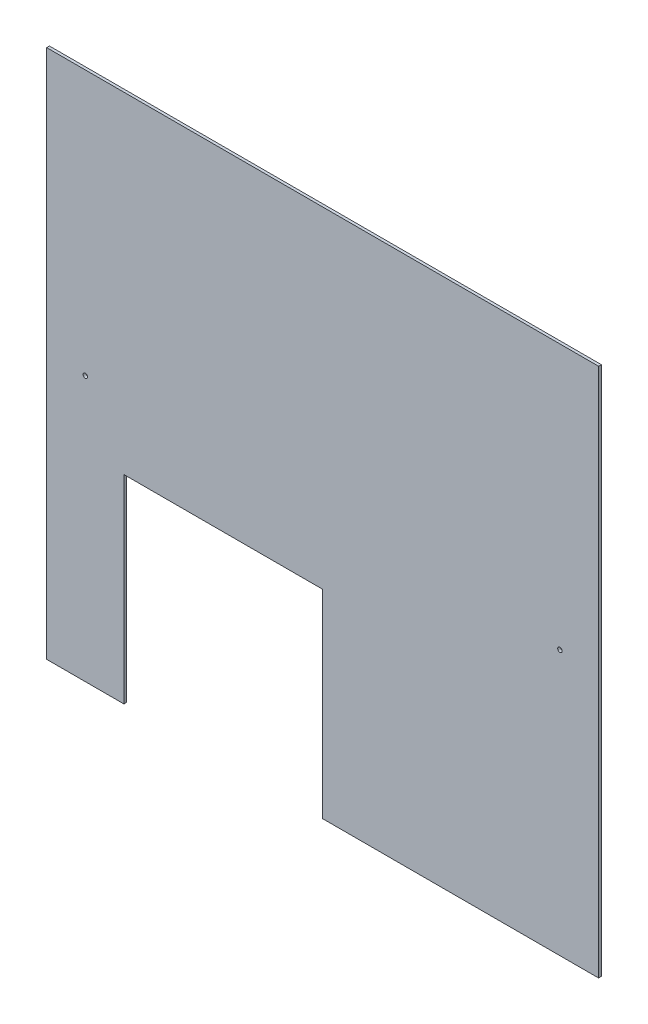
ISO-10303-21;
HEADER;
FILE_DESCRIPTION(('STEP AP214'),'2;1');
FILE_NAME('part.step','',(''),(''),'','','');
FILE_SCHEMA(('AUTOMOTIVE_DESIGN { 1 0 10303 214 1 1 1 1 }'));
ENDSEC;
DATA;
#1=APPLICATION_CONTEXT('core data for automotive mechanical design processes');
#2=APPLICATION_PROTOCOL_DEFINITION('international standard','automotive_design',2000,#1);
#3=PRODUCT_CONTEXT('',#1,'mechanical');
#4=PRODUCT('Part','Part','',(#3));
#5=PRODUCT_RELATED_PRODUCT_CATEGORY('part','',(#4));
#6=PRODUCT_DEFINITION_FORMATION('','',#4);
#7=PRODUCT_DEFINITION_CONTEXT('part definition',#1,'design');
#8=PRODUCT_DEFINITION('design','',#6,#7);
#9=PRODUCT_DEFINITION_SHAPE('','',#8);
#10=(LENGTH_UNIT() NAMED_UNIT(*) SI_UNIT(.MILLI.,.METRE.));
#11=(NAMED_UNIT(*) PLANE_ANGLE_UNIT() SI_UNIT($,.RADIAN.));
#12=(NAMED_UNIT(*) SI_UNIT($,.STERADIAN.) SOLID_ANGLE_UNIT());
#13=UNCERTAINTY_MEASURE_WITH_UNIT(LENGTH_MEASURE(1.E-05),#10,'distance_accuracy_value','');
#14=(GEOMETRIC_REPRESENTATION_CONTEXT(3) GLOBAL_UNCERTAINTY_ASSIGNED_CONTEXT((#13)) GLOBAL_UNIT_ASSIGNED_CONTEXT((#10,
#11,#12)) REPRESENTATION_CONTEXT('',''));
#15=CARTESIAN_POINT('',(0.,0.,0.));
#16=DIRECTION('',(0.,0.,1.));
#17=DIRECTION('',(1.,0.,0.));
#18=AXIS2_PLACEMENT_3D('',#15,#16,#17);
#19=CARTESIAN_POINT('',(-307.14399363564,177.315035799523,3.175));
#20=DIRECTION('',(1.,0.,0.));
#21=DIRECTION('',(0.,0.,-1.));
#22=AXIS2_PLACEMENT_3D('',#19,#20,#21);
#23=PLANE('',#22);
#24=DIRECTION('',(0.,-1.,0.));
#25=VECTOR('',#24,1.);
#26=CARTESIAN_POINT('',(-307.14399363564,177.315035799523,0.));
#27=LINE('',#26,#25);
#28=CARTESIAN_POINT('',(-307.14399363564,177.315035799523,0.));
#29=VERTEX_POINT('',#28);
#30=CARTESIAN_POINT('',(-307.14399363564,-432.284964200477,0.));
#31=VERTEX_POINT('',#30);
#32=EDGE_CURVE('E132',#29,#31,#27,.T.);
#33=ORIENTED_EDGE('',*,*,#32,.T.);
#34=DIRECTION('',(0.,0.,-1.));
#35=VECTOR('',#34,1.);
#36=CARTESIAN_POINT('',(-307.14399363564,-432.284964200477,3.175));
#37=LINE('',#36,#35);
#38=CARTESIAN_POINT('',(-307.14399363564,-432.284964200477,3.175));
#39=VERTEX_POINT('',#38);
#40=EDGE_CURVE('E11',#39,#31,#37,.T.);
#41=ORIENTED_EDGE('',*,*,#40,.F.);
#42=DIRECTION('',(0.,-1.,0.));
#43=VECTOR('',#42,1.);
#44=CARTESIAN_POINT('',(-307.14399363564,177.315035799523,3.175));
#45=LINE('',#44,#43);
#46=CARTESIAN_POINT('',(-307.14399363564,177.315035799523,3.175));
#47=VERTEX_POINT('',#46);
#48=EDGE_CURVE('E147',#47,#39,#45,.T.);
#49=ORIENTED_EDGE('',*,*,#48,.F.);
#50=DIRECTION('',(0.,0.,-1.));
#51=VECTOR('',#50,1.);
#52=CARTESIAN_POINT('',(-307.14399363564,177.315035799523,3.175));
#53=LINE('',#52,#51);
#54=EDGE_CURVE('E128',#47,#29,#53,.T.);
#55=ORIENTED_EDGE('',*,*,#54,.T.);
#56=EDGE_LOOP('',(#33,#41,#49,#55));
#57=FACE_BOUND('',#56,.T.);
#58=ADVANCED_FACE('F36',(#57),#23,.F.);
#59=CARTESIAN_POINT('',(-307.14399363564,-432.284964200477,3.175));
#60=DIRECTION('',(0.,1.,0.));
#61=DIRECTION('',(0.,0.,1.));
#62=AXIS2_PLACEMENT_3D('',#59,#60,#61);
#63=PLANE('',#62);
#64=DIRECTION('',(1.,0.,0.));
#65=VECTOR('',#64,1.);
#66=CARTESIAN_POINT('',(-307.14399363564,-432.284964200477,0.));
#67=LINE('',#66,#65);
#68=CARTESIAN_POINT('',(-218.24399363564,-432.284964200477,0.));
#69=VERTEX_POINT('',#68);
#70=EDGE_CURVE('E135',#31,#69,#67,.T.);
#71=ORIENTED_EDGE('',*,*,#70,.T.);
#72=DIRECTION('',(0.,0.,-1.));
#73=VECTOR('',#72,1.);
#74=CARTESIAN_POINT('',(-218.24399363564,-432.284964200477,3.175));
#75=LINE('',#74,#73);
#76=CARTESIAN_POINT('',(-218.24399363564,-432.284964200477,3.175));
#77=VERTEX_POINT('',#76);
#78=EDGE_CURVE('E44',#77,#69,#75,.T.);
#79=ORIENTED_EDGE('',*,*,#78,.F.);
#80=DIRECTION('',(1.,0.,0.));
#81=VECTOR('',#80,1.);
#82=CARTESIAN_POINT('',(-307.14399363564,-432.284964200477,3.175));
#83=LINE('',#82,#81);
#84=EDGE_CURVE('E95',#39,#77,#83,.T.);
#85=ORIENTED_EDGE('',*,*,#84,.F.);
#86=ORIENTED_EDGE('',*,*,#40,.T.);
#87=EDGE_LOOP('',(#71,#79,#85,#86));
#88=FACE_BOUND('',#87,.T.);
#89=ADVANCED_FACE('F216',(#88),#63,.F.);
#90=CARTESIAN_POINT('',(-218.24399363564,-432.284964200477,3.175));
#91=DIRECTION('',(-1.,0.,0.));
#92=DIRECTION('',(0.,0.,1.));
#93=AXIS2_PLACEMENT_3D('',#90,#91,#92);
#94=PLANE('',#93);
#95=DIRECTION('',(0.,1.,0.));
#96=VECTOR('',#95,1.);
#97=CARTESIAN_POINT('',(-218.24399363564,-432.284964200477,0.));
#98=LINE('',#97,#96);
#99=CARTESIAN_POINT('',(-218.24399363564,-203.684964200477,0.));
#100=VERTEX_POINT('',#99);
#101=EDGE_CURVE('E138',#69,#100,#98,.T.);
#102=ORIENTED_EDGE('',*,*,#101,.T.);
#103=DIRECTION('',(0.,0.,-1.));
#104=VECTOR('',#103,1.);
#105=CARTESIAN_POINT('',(-218.24399363564,-203.684964200477,3.175));
#106=LINE('',#105,#104);
#107=CARTESIAN_POINT('',(-218.24399363564,-203.684964200477,3.175));
#108=VERTEX_POINT('',#107);
#109=EDGE_CURVE('E154',#108,#100,#106,.T.);
#110=ORIENTED_EDGE('',*,*,#109,.F.);
#111=DIRECTION('',(0.,1.,0.));
#112=VECTOR('',#111,1.);
#113=CARTESIAN_POINT('',(-218.24399363564,-432.284964200477,3.175));
#114=LINE('',#113,#112);
#115=EDGE_CURVE('E162',#77,#108,#114,.T.);
#116=ORIENTED_EDGE('',*,*,#115,.F.);
#117=ORIENTED_EDGE('',*,*,#78,.T.);
#118=EDGE_LOOP('',(#102,#110,#116,#117));
#119=FACE_BOUND('',#118,.T.);
#120=ADVANCED_FACE('F160',(#119),#94,.F.);
#121=CARTESIAN_POINT('',(-218.24399363564,-203.684964200477,3.175));
#122=DIRECTION('',(0.,1.,0.));
#123=DIRECTION('',(0.,0.,1.));
#124=AXIS2_PLACEMENT_3D('',#121,#122,#123);
#125=PLANE('',#124);
#126=DIRECTION('',(1.,0.,0.));
#127=VECTOR('',#126,1.);
#128=CARTESIAN_POINT('',(-218.24399363564,-203.684964200477,0.));
#129=LINE('',#128,#127);
#130=CARTESIAN_POINT('',(10.3560063643596,-203.684964200477,0.));
#131=VERTEX_POINT('',#130);
#132=EDGE_CURVE('E140',#100,#131,#129,.T.);
#133=ORIENTED_EDGE('',*,*,#132,.T.);
#134=DIRECTION('',(0.,0.,-1.));
#135=VECTOR('',#134,1.);
#136=CARTESIAN_POINT('',(10.3560063643596,-203.684964200477,3.175));
#137=LINE('',#136,#135);
#138=CARTESIAN_POINT('',(10.3560063643596,-203.684964200477,3.175));
#139=VERTEX_POINT('',#138);
#140=EDGE_CURVE('E151',#139,#131,#137,.T.);
#141=ORIENTED_EDGE('',*,*,#140,.F.);
#142=DIRECTION('',(1.,0.,0.));
#143=VECTOR('',#142,1.);
#144=CARTESIAN_POINT('',(-218.24399363564,-203.684964200477,3.175));
#145=LINE('',#144,#143);
#146=EDGE_CURVE('E174',#108,#139,#145,.T.);
#147=ORIENTED_EDGE('',*,*,#146,.F.);
#148=ORIENTED_EDGE('',*,*,#109,.T.);
#149=EDGE_LOOP('',(#133,#141,#147,#148));
#150=FACE_BOUND('',#149,.T.);
#151=ADVANCED_FACE('F170',(#150),#125,.F.);
#152=CARTESIAN_POINT('',(10.3560063643596,-203.684964200477,3.175));
#153=DIRECTION('',(1.,0.,0.));
#154=DIRECTION('',(0.,1.,0.));
#155=AXIS2_PLACEMENT_3D('',#152,#153,#154);
#156=PLANE('',#155);
#157=DIRECTION('',(0.,-1.,0.));
#158=VECTOR('',#157,1.);
#159=CARTESIAN_POINT('',(10.3560063643596,-203.684964200477,0.));
#160=LINE('',#159,#158);
#161=CARTESIAN_POINT('',(10.3560063643596,-432.284964200477,0.));
#162=VERTEX_POINT('',#161);
#163=EDGE_CURVE('E142',#131,#162,#160,.T.);
#164=ORIENTED_EDGE('',*,*,#163,.T.);
#165=DIRECTION('',(0.,0.,-1.));
#166=VECTOR('',#165,1.);
#167=CARTESIAN_POINT('',(10.3560063643596,-432.284964200477,3.175));
#168=LINE('',#167,#166);
#169=CARTESIAN_POINT('',(10.3560063643596,-432.284964200477,3.175));
#170=VERTEX_POINT('',#169);
#171=EDGE_CURVE('E123',#170,#162,#168,.T.);
#172=ORIENTED_EDGE('',*,*,#171,.F.);
#173=DIRECTION('',(0.,-1.,0.));
#174=VECTOR('',#173,1.);
#175=CARTESIAN_POINT('',(10.3560063643596,-203.684964200477,3.175));
#176=LINE('',#175,#174);
#177=EDGE_CURVE('E114',#139,#170,#176,.T.);
#178=ORIENTED_EDGE('',*,*,#177,.F.);
#179=ORIENTED_EDGE('',*,*,#140,.T.);
#180=EDGE_LOOP('',(#164,#172,#178,#179));
#181=FACE_BOUND('',#180,.T.);
#182=ADVANCED_FACE('F173',(#181),#156,.F.);
#183=CARTESIAN_POINT('',(10.3560063643596,-432.284964200477,3.175));
#184=DIRECTION('',(0.,1.,0.));
#185=DIRECTION('',(0.,0.,1.));
#186=AXIS2_PLACEMENT_3D('',#183,#184,#185);
#187=PLANE('',#186);
#188=DIRECTION('',(1.,0.,0.));
#189=VECTOR('',#188,1.);
#190=CARTESIAN_POINT('',(10.3560063643596,-432.284964200477,0.));
#191=LINE('',#190,#189);
#192=CARTESIAN_POINT('',(327.85600636436,-432.284964200477,0.));
#193=VERTEX_POINT('',#192);
#194=EDGE_CURVE('E122',#162,#193,#191,.T.);
#195=ORIENTED_EDGE('',*,*,#194,.T.);
#196=DIRECTION('',(0.,0.,-1.));
#197=VECTOR('',#196,1.);
#198=CARTESIAN_POINT('',(327.85600636436,-432.284964200477,3.175));
#199=LINE('',#198,#197);
#200=CARTESIAN_POINT('',(327.85600636436,-432.284964200477,3.175));
#201=VERTEX_POINT('',#200);
#202=EDGE_CURVE('E119',#201,#193,#199,.T.);
#203=ORIENTED_EDGE('',*,*,#202,.F.);
#204=DIRECTION('',(1.,0.,0.));
#205=VECTOR('',#204,1.);
#206=CARTESIAN_POINT('',(10.3560063643596,-432.284964200477,3.175));
#207=LINE('',#206,#205);
#208=EDGE_CURVE('E108',#170,#201,#207,.T.);
#209=ORIENTED_EDGE('',*,*,#208,.F.);
#210=ORIENTED_EDGE('',*,*,#171,.T.);
#211=EDGE_LOOP('',(#195,#203,#209,#210));
#212=FACE_BOUND('',#211,.T.);
#213=ADVANCED_FACE('F120',(#212),#187,.F.);
#214=CARTESIAN_POINT('',(327.85600636436,177.315035799523,3.175));
#215=DIRECTION('',(-1.,0.,0.));
#216=DIRECTION('',(0.,-1.,0.));
#217=AXIS2_PLACEMENT_3D('',#214,#215,#216);
#218=PLANE('',#217);
#219=DIRECTION('',(0.,1.,0.));
#220=VECTOR('',#219,1.);
#221=CARTESIAN_POINT('',(327.85600636436,177.315035799523,0.));
#222=LINE('',#221,#220);
#223=CARTESIAN_POINT('',(327.85600636436,177.315035799523,0.));
#224=VERTEX_POINT('',#223);
#225=EDGE_CURVE('E81',#193,#224,#222,.T.);
#226=ORIENTED_EDGE('',*,*,#225,.T.);
#227=DIRECTION('',(0.,0.,-1.));
#228=VECTOR('',#227,1.);
#229=CARTESIAN_POINT('',(327.85600636436,177.315035799523,3.175));
#230=LINE('',#229,#228);
#231=CARTESIAN_POINT('',(327.85600636436,177.315035799523,3.175));
#232=VERTEX_POINT('',#231);
#233=EDGE_CURVE('E124',#232,#224,#230,.T.);
#234=ORIENTED_EDGE('',*,*,#233,.F.);
#235=DIRECTION('',(0.,1.,0.));
#236=VECTOR('',#235,1.);
#237=CARTESIAN_POINT('',(327.85600636436,177.315035799523,3.175));
#238=LINE('',#237,#236);
#239=EDGE_CURVE('E112',#201,#232,#238,.T.);
#240=ORIENTED_EDGE('',*,*,#239,.F.);
#241=ORIENTED_EDGE('',*,*,#202,.T.);
#242=EDGE_LOOP('',(#226,#234,#240,#241));
#243=FACE_BOUND('',#242,.T.);
#244=ADVANCED_FACE('F126',(#243),#218,.F.);
#245=CARTESIAN_POINT('',(-307.14399363564,177.315035799523,3.175));
#246=DIRECTION('',(0.,-1.,0.));
#247=DIRECTION('',(0.,0.,-1.));
#248=AXIS2_PLACEMENT_3D('',#245,#246,#247);
#249=PLANE('',#248);
#250=DIRECTION('',(-1.,0.,0.));
#251=VECTOR('',#250,1.);
#252=CARTESIAN_POINT('',(-307.14399363564,177.315035799523,0.));
#253=LINE('',#252,#251);
#254=EDGE_CURVE('E87',#224,#29,#253,.T.);
#255=ORIENTED_EDGE('',*,*,#254,.T.);
#256=ORIENTED_EDGE('',*,*,#54,.F.);
#257=DIRECTION('',(-1.,0.,0.));
#258=VECTOR('',#257,1.);
#259=CARTESIAN_POINT('',(-307.14399363564,177.315035799523,3.175));
#260=LINE('',#259,#258);
#261=EDGE_CURVE('E52',#232,#47,#260,.T.);
#262=ORIENTED_EDGE('',*,*,#261,.F.);
#263=ORIENTED_EDGE('',*,*,#233,.T.);
#264=EDGE_LOOP('',(#255,#256,#262,#263));
#265=FACE_BOUND('',#264,.T.);
#266=ADVANCED_FACE('F203',(#265),#249,.F.);
#267=CARTESIAN_POINT('',(0.,0.,3.175));
#268=DIRECTION('',(0.,0.,1.));
#269=DIRECTION('',(1.,0.,0.));
#270=AXIS2_PLACEMENT_3D('',#267,#268,#269);
#271=PLANE('',#270);
#272=CARTESIAN_POINT('',(-262.69399363564,-127.484964200477,3.175));
#273=DIRECTION('',(0.,0.,1.));
#274=DIRECTION('',(1.,0.,0.));
#275=AXIS2_PLACEMENT_3D('',#272,#273,#274);
#276=CIRCLE('',#275,2.57968750000001);
#277=CARTESIAN_POINT('',(-260.11430613564,-127.484964200477,3.175));
#278=VERTEX_POINT('',#277);
#279=EDGE_CURVE('E186',#278,#278,#276,.T.);
#280=ORIENTED_EDGE('',*,*,#279,.F.);
#281=EDGE_LOOP('',(#280));
#282=FACE_BOUND('',#281,.T.);
#283=CARTESIAN_POINT('',(283.40600636436,-127.484964200477,3.175));
#284=DIRECTION('',(0.,0.,1.));
#285=DIRECTION('',(1.,0.,0.));
#286=AXIS2_PLACEMENT_3D('',#283,#284,#285);
#287=CIRCLE('',#286,2.57968750000001);
#288=CARTESIAN_POINT('',(285.98569386436,-127.484964200477,3.175));
#289=VERTEX_POINT('',#288);
#290=EDGE_CURVE('E180',#289,#289,#287,.T.);
#291=ORIENTED_EDGE('',*,*,#290,.F.);
#292=EDGE_LOOP('',(#291));
#293=FACE_BOUND('',#292,.T.);
#294=ORIENTED_EDGE('',*,*,#48,.T.);
#295=ORIENTED_EDGE('',*,*,#84,.T.);
#296=ORIENTED_EDGE('',*,*,#115,.T.);
#297=ORIENTED_EDGE('',*,*,#146,.T.);
#298=ORIENTED_EDGE('',*,*,#177,.T.);
#299=ORIENTED_EDGE('',*,*,#208,.T.);
#300=ORIENTED_EDGE('',*,*,#239,.T.);
#301=ORIENTED_EDGE('',*,*,#261,.T.);
#302=EDGE_LOOP('',(#294,#295,#296,#297,#298,#299,#300,#301));
#303=FACE_BOUND('',#302,.T.);
#304=ADVANCED_FACE('F110',(#282,#293,#303),#271,.T.);
#305=CARTESIAN_POINT('',(0.,0.,0.));
#306=DIRECTION('',(0.,0.,1.));
#307=DIRECTION('',(1.,0.,0.));
#308=AXIS2_PLACEMENT_3D('',#305,#306,#307);
#309=PLANE('',#308);
#310=CARTESIAN_POINT('',(-262.69399363564,-127.484964200477,0.));
#311=DIRECTION('',(0.,0.,1.));
#312=DIRECTION('',(1.,0.,0.));
#313=AXIS2_PLACEMENT_3D('',#310,#311,#312);
#314=CIRCLE('',#313,2.57968750000001);
#315=CARTESIAN_POINT('',(-260.11430613564,-127.484964200477,0.));
#316=VERTEX_POINT('',#315);
#317=EDGE_CURVE('E136',#316,#316,#314,.T.);
#318=ORIENTED_EDGE('',*,*,#317,.T.);
#319=EDGE_LOOP('',(#318));
#320=FACE_BOUND('',#319,.T.);
#321=CARTESIAN_POINT('',(283.40600636436,-127.484964200477,0.));
#322=DIRECTION('',(0.,0.,1.));
#323=DIRECTION('',(1.,0.,0.));
#324=AXIS2_PLACEMENT_3D('',#321,#322,#323);
#325=CIRCLE('',#324,2.57968750000001);
#326=CARTESIAN_POINT('',(285.98569386436,-127.484964200477,0.));
#327=VERTEX_POINT('',#326);
#328=EDGE_CURVE('E183',#327,#327,#325,.T.);
#329=ORIENTED_EDGE('',*,*,#328,.T.);
#330=EDGE_LOOP('',(#329));
#331=FACE_BOUND('',#330,.T.);
#332=ORIENTED_EDGE('',*,*,#32,.F.);
#333=ORIENTED_EDGE('',*,*,#254,.F.);
#334=ORIENTED_EDGE('',*,*,#225,.F.);
#335=ORIENTED_EDGE('',*,*,#194,.F.);
#336=ORIENTED_EDGE('',*,*,#163,.F.);
#337=ORIENTED_EDGE('',*,*,#132,.F.);
#338=ORIENTED_EDGE('',*,*,#101,.F.);
#339=ORIENTED_EDGE('',*,*,#70,.F.);
#340=EDGE_LOOP('',(#332,#333,#334,#335,#336,#337,#338,#339));
#341=FACE_BOUND('',#340,.T.);
#342=ADVANCED_FACE('F166',(#320,#331,#341),#309,.F.);
#343=CARTESIAN_POINT('',(283.40600636436,-127.484964200477,0.));
#344=DIRECTION('',(0.,0.,1.));
#345=DIRECTION('',(1.,0.,0.));
#346=AXIS2_PLACEMENT_3D('',#343,#344,#345);
#347=CYLINDRICAL_SURFACE('',#346,2.57968750000001);
#348=ORIENTED_EDGE('',*,*,#328,.F.);
#349=EDGE_LOOP('',(#348));
#350=FACE_BOUND('',#349,.T.);
#351=ORIENTED_EDGE('',*,*,#290,.T.);
#352=EDGE_LOOP('',(#351));
#353=FACE_BOUND('',#352,.T.);
#354=ADVANCED_FACE('F197',(#350,#353),#347,.F.);
#355=CARTESIAN_POINT('',(-262.69399363564,-127.484964200477,0.));
#356=DIRECTION('',(0.,0.,1.));
#357=DIRECTION('',(1.,0.,0.));
#358=AXIS2_PLACEMENT_3D('',#355,#356,#357);
#359=CYLINDRICAL_SURFACE('',#358,2.57968750000001);
#360=ORIENTED_EDGE('',*,*,#317,.F.);
#361=EDGE_LOOP('',(#360));
#362=FACE_BOUND('',#361,.T.);
#363=ORIENTED_EDGE('',*,*,#279,.T.);
#364=EDGE_LOOP('',(#363));
#365=FACE_BOUND('',#364,.T.);
#366=ADVANCED_FACE('F194',(#362,#365),#359,.F.);
#367=CLOSED_SHELL('',(#58,#89,#120,#151,#182,#213,#244,#266,#304,#342,#354,#366));
#368=MANIFOLD_SOLID_BREP('B2',#367);
#369=ADVANCED_BREP_SHAPE_REPRESENTATION('',(#18,#368),#14);
#370=SHAPE_DEFINITION_REPRESENTATION(#9,#369);
ENDSEC;
END-ISO-10303-21;
